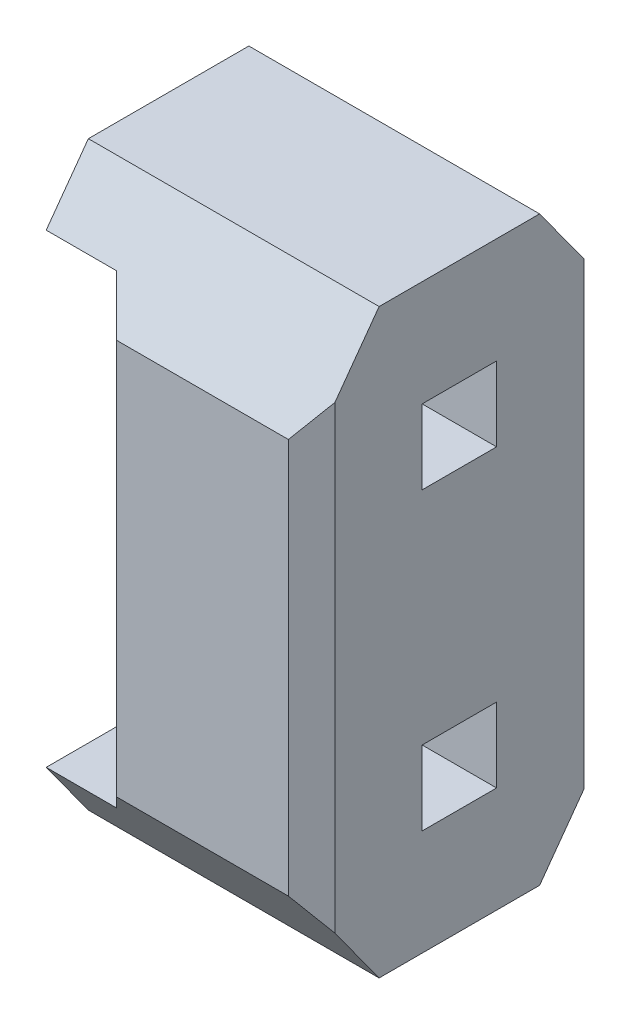
ISO-10303-21;
HEADER;
FILE_DESCRIPTION(('STEP AP214'),'2;1');
FILE_NAME('part.step','',(''),(''),'','','');
FILE_SCHEMA(('AUTOMOTIVE_DESIGN { 1 0 10303 214 1 1 1 1 }'));
ENDSEC;
DATA;
#1=APPLICATION_CONTEXT('core data for automotive mechanical design processes');
#2=APPLICATION_PROTOCOL_DEFINITION('international standard','automotive_design',2000,#1);
#3=PRODUCT_CONTEXT('',#1,'mechanical');
#4=PRODUCT('Part','Part','',(#3));
#5=PRODUCT_RELATED_PRODUCT_CATEGORY('part','',(#4));
#6=PRODUCT_DEFINITION_FORMATION('','',#4);
#7=PRODUCT_DEFINITION_CONTEXT('part definition',#1,'design');
#8=PRODUCT_DEFINITION('design','',#6,#7);
#9=PRODUCT_DEFINITION_SHAPE('','',#8);
#10=(LENGTH_UNIT() NAMED_UNIT(*) SI_UNIT(.MILLI.,.METRE.));
#11=(NAMED_UNIT(*) PLANE_ANGLE_UNIT() SI_UNIT($,.RADIAN.));
#12=(NAMED_UNIT(*) SI_UNIT($,.STERADIAN.) SOLID_ANGLE_UNIT());
#13=UNCERTAINTY_MEASURE_WITH_UNIT(LENGTH_MEASURE(1.E-05),#10,'distance_accuracy_value','');
#14=(GEOMETRIC_REPRESENTATION_CONTEXT(3) GLOBAL_UNCERTAINTY_ASSIGNED_CONTEXT((#13)) GLOBAL_UNIT_ASSIGNED_CONTEXT((#10,
#11,#12)) REPRESENTATION_CONTEXT('',''));
#15=CARTESIAN_POINT('',(0.,0.,0.));
#16=DIRECTION('',(0.,0.,1.));
#17=DIRECTION('',(1.,0.,0.));
#18=AXIS2_PLACEMENT_3D('',#15,#16,#17);
#19=CARTESIAN_POINT('',(1.25,4.6,-40.93));
#20=DIRECTION('',(0.,0.586967571460905,0.809610443394407));
#21=DIRECTION('',(0.,-0.809610443394407,0.586967571460905));
#22=AXIS2_PLACEMENT_3D('',#19,#20,#21);
#23=PLANE('',#22);
#24=DIRECTION('',(1.,0.,0.));
#25=VECTOR('',#24,1.);
#26=CARTESIAN_POINT('',(1.25,4.5,-40.8575));
#27=LINE('',#26,#25);
#28=CARTESIAN_POINT('',(0.,4.5,-40.8575));
#29=VERTEX_POINT('',#28);
#30=CARTESIAN_POINT('',(0.602500000000325,4.5,-40.8575000000001));
#31=VERTEX_POINT('',#30);
#32=EDGE_CURVE('E199',#29,#31,#27,.T.);
#33=ORIENTED_EDGE('',*,*,#32,.T.);
#34=DIRECTION('',(0.506207656348697,-0.698217457033984,0.506207656349602));
#35=VECTOR('',#34,1.);
#36=CARTESIAN_POINT('',(0.6025000000002,4.5,-40.8575));
#37=LINE('',#36,#35);
#38=CARTESIAN_POINT('',(0.819999999999671,4.2,-40.6399999999999));
#39=VERTEX_POINT('',#38);
#40=EDGE_CURVE('E197',#31,#39,#37,.T.);
#41=ORIENTED_EDGE('',*,*,#40,.T.);
#42=DIRECTION('',(1.,0.,0.));
#43=VECTOR('',#42,1.);
#44=CARTESIAN_POINT('',(1.25,4.19999999999999,-40.64));
#45=LINE('',#44,#43);
#46=CARTESIAN_POINT('',(2.30000000000012,4.2,-40.6399999999999));
#47=VERTEX_POINT('',#46);
#48=EDGE_CURVE('E20',#39,#47,#45,.T.);
#49=ORIENTED_EDGE('',*,*,#48,.T.);
#50=DIRECTION('',(0.506207656348957,0.698217457033858,-0.506207656349515));
#51=VECTOR('',#50,1.);
#52=CARTESIAN_POINT('',(2.3,4.19999999999999,-40.64));
#53=LINE('',#52,#51);
#54=CARTESIAN_POINT('',(2.49999999999988,4.47586206896592,-40.8400000000002));
#55=VERTEX_POINT('',#54);
#56=EDGE_CURVE('E181',#47,#55,#53,.T.);
#57=ORIENTED_EDGE('',*,*,#56,.T.);
#58=DIRECTION('',(0.,-0.809610443394407,0.586967571460905));
#59=VECTOR('',#58,1.);
#60=CARTESIAN_POINT('',(2.5,4.6,-40.93));
#61=LINE('',#60,#59);
#62=CARTESIAN_POINT('',(2.5,5.,-41.22));
#63=VERTEX_POINT('',#62);
#64=EDGE_CURVE('E188',#55,#63,#61,.F.);
#65=ORIENTED_EDGE('',*,*,#64,.T.);
#66=DIRECTION('',(1.,0.,0.));
#67=VECTOR('',#66,1.);
#68=CARTESIAN_POINT('',(1.25,5.,-41.22));
#69=LINE('',#68,#67);
#70=CARTESIAN_POINT('',(0.,5.,-41.22));
#71=VERTEX_POINT('',#70);
#72=EDGE_CURVE('E215',#71,#63,#69,.T.);
#73=ORIENTED_EDGE('',*,*,#72,.F.);
#74=DIRECTION('',(0.,-0.809610443394407,0.586967571460905));
#75=VECTOR('',#74,1.);
#76=CARTESIAN_POINT('',(0.,4.6,-40.93));
#77=LINE('',#76,#75);
#78=EDGE_CURVE('E207',#71,#29,#77,.T.);
#79=ORIENTED_EDGE('',*,*,#78,.T.);
#80=EDGE_LOOP('',(#33,#41,#49,#57,#65,#73,#79));
#81=FACE_BOUND('',#80,.T.);
#82=ADVANCED_FACE('F17',(#81),#23,.T.);
#83=CARTESIAN_POINT('',(1.25,4.6,-42.89));
#84=DIRECTION('',(0.,-0.586967571460905,0.809610443394407));
#85=DIRECTION('',(0.,-0.809610443394407,-0.586967571460905));
#86=AXIS2_PLACEMENT_3D('',#83,#84,#85);
#87=PLANE('',#86);
#88=DIRECTION('',(0.,-0.809610443394407,-0.586967571460905));
#89=VECTOR('',#88,1.);
#90=CARTESIAN_POINT('',(0.,4.6,-42.89));
#91=LINE('',#90,#89);
#92=CARTESIAN_POINT('',(0.,5.00000000000001,-42.6));
#93=VERTEX_POINT('',#92);
#94=CARTESIAN_POINT('',(0.,4.5,-42.9625));
#95=VERTEX_POINT('',#94);
#96=EDGE_CURVE('E263',#93,#95,#91,.T.);
#97=ORIENTED_EDGE('',*,*,#96,.F.);
#98=DIRECTION('',(1.,0.,0.));
#99=VECTOR('',#98,1.);
#100=CARTESIAN_POINT('',(1.25,5.,-42.6));
#101=LINE('',#100,#99);
#102=CARTESIAN_POINT('',(2.5,5.,-42.6));
#103=VERTEX_POINT('',#102);
#104=EDGE_CURVE('E227',#103,#93,#101,.F.);
#105=ORIENTED_EDGE('',*,*,#104,.F.);
#106=DIRECTION('',(0.,-0.809610443394407,-0.586967571460905));
#107=VECTOR('',#106,1.);
#108=CARTESIAN_POINT('',(2.5,4.6,-42.89));
#109=LINE('',#108,#107);
#110=CARTESIAN_POINT('',(2.49999999999988,4.47586206896592,-42.9799999999998));
#111=VERTEX_POINT('',#110);
#112=EDGE_CURVE('E223',#111,#103,#109,.F.);
#113=ORIENTED_EDGE('',*,*,#112,.F.);
#114=DIRECTION('',(0.506207656348954,0.698217457033861,0.506207656349513));
#115=VECTOR('',#114,1.);
#116=CARTESIAN_POINT('',(2.3,4.19999999999999,-43.18));
#117=LINE('',#116,#115);
#118=CARTESIAN_POINT('',(2.30000000000012,4.2,-43.1800000000001));
#119=VERTEX_POINT('',#118);
#120=EDGE_CURVE('E266',#119,#111,#117,.T.);
#121=ORIENTED_EDGE('',*,*,#120,.F.);
#122=DIRECTION('',(1.,0.,0.));
#123=VECTOR('',#122,1.);
#124=CARTESIAN_POINT('',(1.25,4.19999999999999,-43.18));
#125=LINE('',#124,#123);
#126=CARTESIAN_POINT('',(0.819999999999671,4.2,-43.1800000000001));
#127=VERTEX_POINT('',#126);
#128=EDGE_CURVE('E205',#127,#119,#125,.T.);
#129=ORIENTED_EDGE('',*,*,#128,.F.);
#130=DIRECTION('',(0.506207656348697,-0.698217457033984,-0.506207656349602));
#131=VECTOR('',#130,1.);
#132=CARTESIAN_POINT('',(0.6025000000002,4.5,-42.9625));
#133=LINE('',#132,#131);
#134=CARTESIAN_POINT('',(0.602500000000324,4.5,-42.9624999999999));
#135=VERTEX_POINT('',#134);
#136=EDGE_CURVE('E203',#135,#127,#133,.T.);
#137=ORIENTED_EDGE('',*,*,#136,.F.);
#138=DIRECTION('',(1.,0.,0.));
#139=VECTOR('',#138,1.);
#140=CARTESIAN_POINT('',(1.25,4.5,-42.9625));
#141=LINE('',#140,#139);
#142=EDGE_CURVE('E261',#95,#135,#141,.T.);
#143=ORIENTED_EDGE('',*,*,#142,.F.);
#144=EDGE_LOOP('',(#97,#105,#113,#121,#129,#137,#143));
#145=FACE_BOUND('',#144,.T.);
#146=ADVANCED_FACE('F285',(#145),#87,.F.);
#147=CARTESIAN_POINT('',(1.25,0.4,-42.89));
#148=DIRECTION('',(0.,0.586967571460905,0.809610443394407));
#149=DIRECTION('',(0.,-0.809610443394407,0.586967571460905));
#150=AXIS2_PLACEMENT_3D('',#147,#148,#149);
#151=PLANE('',#150);
#152=DIRECTION('',(-0.5062076563494,0.698217457033649,-0.506207656349361));
#153=VECTOR('',#152,1.);
#154=CARTESIAN_POINT('',(2.5,0.524137931034493,-42.98));
#155=LINE('',#154,#153);
#156=CARTESIAN_POINT('',(2.49999999999988,0.524137931034496,-42.9799999999999));
#157=VERTEX_POINT('',#156);
#158=CARTESIAN_POINT('',(2.30000000000012,0.800000000000004,-43.1800000000001));
#159=VERTEX_POINT('',#158);
#160=EDGE_CURVE('E251',#157,#159,#155,.T.);
#161=ORIENTED_EDGE('',*,*,#160,.F.);
#162=DIRECTION('',(0.,-0.809610443394407,0.586967571460905));
#163=VECTOR('',#162,1.);
#164=CARTESIAN_POINT('',(2.5,0.4,-42.89));
#165=LINE('',#164,#163);
#166=CARTESIAN_POINT('',(2.5,0.,-42.6));
#167=VERTEX_POINT('',#166);
#168=EDGE_CURVE('E253',#167,#157,#165,.F.);
#169=ORIENTED_EDGE('',*,*,#168,.F.);
#170=DIRECTION('',(1.,0.,0.));
#171=VECTOR('',#170,1.);
#172=CARTESIAN_POINT('',(1.25,0.,-42.6));
#173=LINE('',#172,#171);
#174=CARTESIAN_POINT('',(0.,0.,-42.6));
#175=VERTEX_POINT('',#174);
#176=EDGE_CURVE('E288',#167,#175,#173,.F.);
#177=ORIENTED_EDGE('',*,*,#176,.T.);
#178=DIRECTION('',(0.,-0.809610443394407,0.586967571460905));
#179=VECTOR('',#178,1.);
#180=CARTESIAN_POINT('',(0.,0.4,-42.89));
#181=LINE('',#180,#179);
#182=CARTESIAN_POINT('',(0.,0.5,-42.9625));
#183=VERTEX_POINT('',#182);
#184=EDGE_CURVE('E255',#183,#175,#181,.T.);
#185=ORIENTED_EDGE('',*,*,#184,.F.);
#186=DIRECTION('',(1.,0.,0.));
#187=VECTOR('',#186,1.);
#188=CARTESIAN_POINT('',(1.25,0.500000000000001,-42.9625));
#189=LINE('',#188,#187);
#190=CARTESIAN_POINT('',(0.602500000000324,0.5,-42.9624999999999));
#191=VERTEX_POINT('',#190);
#192=EDGE_CURVE('E257',#191,#183,#189,.F.);
#193=ORIENTED_EDGE('',*,*,#192,.F.);
#194=DIRECTION('',(-0.506207656348696,-0.698217457033985,0.506207656349601));
#195=VECTOR('',#194,1.);
#196=CARTESIAN_POINT('',(0.8199999999998,0.800000000000008,-43.18));
#197=LINE('',#196,#195);
#198=CARTESIAN_POINT('',(0.819999999999671,0.800000000000004,-43.1800000000001));
#199=VERTEX_POINT('',#198);
#200=EDGE_CURVE('E259',#199,#191,#197,.T.);
#201=ORIENTED_EDGE('',*,*,#200,.F.);
#202=DIRECTION('',(1.,0.,0.));
#203=VECTOR('',#202,1.);
#204=CARTESIAN_POINT('',(1.25,0.800000000000008,-43.18));
#205=LINE('',#204,#203);
#206=EDGE_CURVE('E249',#159,#199,#205,.F.);
#207=ORIENTED_EDGE('',*,*,#206,.F.);
#208=EDGE_LOOP('',(#161,#169,#177,#185,#193,#201,#207));
#209=FACE_BOUND('',#208,.T.);
#210=ADVANCED_FACE('F431',(#209),#151,.F.);
#211=CARTESIAN_POINT('',(1.25,0.4,-40.93));
#212=DIRECTION('',(0.,-0.586967571460905,0.809610443394407));
#213=DIRECTION('',(0.,-0.809610443394407,-0.586967571460905));
#214=AXIS2_PLACEMENT_3D('',#211,#212,#213);
#215=PLANE('',#214);
#216=DIRECTION('',(1.,0.,0.));
#217=VECTOR('',#216,1.);
#218=CARTESIAN_POINT('',(1.25,0.800000000000008,-40.64));
#219=LINE('',#218,#217);
#220=CARTESIAN_POINT('',(2.30000000000012,0.800000000000004,-40.6399999999999));
#221=VERTEX_POINT('',#220);
#222=CARTESIAN_POINT('',(0.819999999999671,0.800000000000004,-40.6399999999999));
#223=VERTEX_POINT('',#222);
#224=EDGE_CURVE('E191',#221,#223,#219,.F.);
#225=ORIENTED_EDGE('',*,*,#224,.T.);
#226=DIRECTION('',(-0.506207656348696,-0.698217457033985,-0.506207656349601));
#227=VECTOR('',#226,1.);
#228=CARTESIAN_POINT('',(0.8199999999998,0.800000000000008,-40.64));
#229=LINE('',#228,#227);
#230=CARTESIAN_POINT('',(0.602500000000324,0.5,-40.8575000000001));
#231=VERTEX_POINT('',#230);
#232=EDGE_CURVE('E232',#223,#231,#229,.T.);
#233=ORIENTED_EDGE('',*,*,#232,.T.);
#234=DIRECTION('',(1.,0.,0.));
#235=VECTOR('',#234,1.);
#236=CARTESIAN_POINT('',(1.25,0.500000000000001,-40.8575));
#237=LINE('',#236,#235);
#238=CARTESIAN_POINT('',(0.,0.5,-40.8575));
#239=VERTEX_POINT('',#238);
#240=EDGE_CURVE('E246',#231,#239,#237,.F.);
#241=ORIENTED_EDGE('',*,*,#240,.T.);
#242=DIRECTION('',(0.,-0.809610443394407,-0.586967571460905));
#243=VECTOR('',#242,1.);
#244=CARTESIAN_POINT('',(0.,0.4,-40.93));
#245=LINE('',#244,#243);
#246=CARTESIAN_POINT('',(0.,0.,-41.22));
#247=VERTEX_POINT('',#246);
#248=EDGE_CURVE('E244',#239,#247,#245,.T.);
#249=ORIENTED_EDGE('',*,*,#248,.T.);
#250=DIRECTION('',(1.,0.,0.));
#251=VECTOR('',#250,1.);
#252=CARTESIAN_POINT('',(1.25,0.,-41.22));
#253=LINE('',#252,#251);
#254=CARTESIAN_POINT('',(2.5,0.,-41.22));
#255=VERTEX_POINT('',#254);
#256=EDGE_CURVE('E293',#247,#255,#253,.T.);
#257=ORIENTED_EDGE('',*,*,#256,.T.);
#258=DIRECTION('',(0.,-0.809610443394407,-0.586967571460905));
#259=VECTOR('',#258,1.);
#260=CARTESIAN_POINT('',(2.5,0.4,-40.93));
#261=LINE('',#260,#259);
#262=CARTESIAN_POINT('',(2.49999999999988,0.524137931034499,-40.8400000000001));
#263=VERTEX_POINT('',#262);
#264=EDGE_CURVE('E241',#255,#263,#261,.F.);
#265=ORIENTED_EDGE('',*,*,#264,.T.);
#266=DIRECTION('',(-0.506207656349409,0.698217457033648,0.506207656349353));
#267=VECTOR('',#266,1.);
#268=CARTESIAN_POINT('',(2.5,0.524137931034498,-40.84));
#269=LINE('',#268,#267);
#270=EDGE_CURVE('E239',#263,#221,#269,.T.);
#271=ORIENTED_EDGE('',*,*,#270,.T.);
#272=EDGE_LOOP('',(#225,#233,#241,#249,#257,#265,#271));
#273=FACE_BOUND('',#272,.T.);
#274=ADVANCED_FACE('F421',(#273),#215,.T.);
#275=CARTESIAN_POINT('',(1.25,5.,-41.91));
#276=DIRECTION('',(0.,1.,0.));
#277=DIRECTION('',(0.,0.,1.));
#278=AXIS2_PLACEMENT_3D('',#275,#276,#277);
#279=PLANE('',#278);
#280=ORIENTED_EDGE('',*,*,#104,.T.);
#281=DIRECTION('',(0.,0.,-1.));
#282=VECTOR('',#281,1.);
#283=CARTESIAN_POINT('',(0.,5.,-41.91));
#284=LINE('',#283,#282);
#285=EDGE_CURVE('E231',#93,#71,#284,.F.);
#286=ORIENTED_EDGE('',*,*,#285,.T.);
#287=ORIENTED_EDGE('',*,*,#72,.T.);
#288=DIRECTION('',(0.,0.,1.));
#289=VECTOR('',#288,1.);
#290=CARTESIAN_POINT('',(2.5,5.,-41.91));
#291=LINE('',#290,#289);
#292=EDGE_CURVE('E219',#63,#103,#291,.F.);
#293=ORIENTED_EDGE('',*,*,#292,.T.);
#294=EDGE_LOOP('',(#280,#286,#287,#293));
#295=FACE_BOUND('',#294,.T.);
#296=ADVANCED_FACE('F229',(#295),#279,.T.);
#297=CARTESIAN_POINT('',(1.25,0.,-41.91));
#298=DIRECTION('',(0.,1.,0.));
#299=DIRECTION('',(0.,0.,1.));
#300=AXIS2_PLACEMENT_3D('',#297,#298,#299);
#301=PLANE('',#300);
#302=DIRECTION('',(0.,0.,-1.));
#303=VECTOR('',#302,1.);
#304=CARTESIAN_POINT('',(0.,0.,-41.91));
#305=LINE('',#304,#303);
#306=EDGE_CURVE('E297',#247,#175,#305,.T.);
#307=ORIENTED_EDGE('',*,*,#306,.T.);
#308=ORIENTED_EDGE('',*,*,#176,.F.);
#309=DIRECTION('',(0.,0.,1.));
#310=VECTOR('',#309,1.);
#311=CARTESIAN_POINT('',(2.5,0.,-41.91));
#312=LINE('',#311,#310);
#313=EDGE_CURVE('E287',#255,#167,#312,.F.);
#314=ORIENTED_EDGE('',*,*,#313,.F.);
#315=ORIENTED_EDGE('',*,*,#256,.F.);
#316=EDGE_LOOP('',(#307,#308,#314,#315));
#317=FACE_BOUND('',#316,.T.);
#318=ADVANCED_FACE('F428',(#317),#301,.F.);
#319=CARTESIAN_POINT('',(0.,4.75,-41.91));
#320=DIRECTION('',(1.,0.,0.));
#321=DIRECTION('',(0.,0.,-1.));
#322=AXIS2_PLACEMENT_3D('',#319,#320,#321);
#323=PLANE('',#322);
#324=ORIENTED_EDGE('',*,*,#285,.F.);
#325=ORIENTED_EDGE('',*,*,#96,.T.);
#326=DIRECTION('',(0.,0.,1.));
#327=VECTOR('',#326,1.);
#328=CARTESIAN_POINT('',(0.,4.5,-41.91));
#329=LINE('',#328,#327);
#330=EDGE_CURVE('E307',#95,#29,#329,.T.);
#331=ORIENTED_EDGE('',*,*,#330,.T.);
#332=ORIENTED_EDGE('',*,*,#78,.F.);
#333=EDGE_LOOP('',(#324,#325,#331,#332));
#334=FACE_BOUND('',#333,.T.);
#335=ADVANCED_FACE('F441',(#334),#323,.F.);
#336=CARTESIAN_POINT('',(0.,0.25,-41.91));
#337=DIRECTION('',(1.,0.,0.));
#338=DIRECTION('',(0.,0.,-1.));
#339=AXIS2_PLACEMENT_3D('',#336,#337,#338);
#340=PLANE('',#339);
#341=ORIENTED_EDGE('',*,*,#306,.F.);
#342=ORIENTED_EDGE('',*,*,#248,.F.);
#343=DIRECTION('',(0.,0.,1.));
#344=VECTOR('',#343,1.);
#345=CARTESIAN_POINT('',(0.,0.5,-41.91));
#346=LINE('',#345,#344);
#347=EDGE_CURVE('E315',#183,#239,#346,.T.);
#348=ORIENTED_EDGE('',*,*,#347,.F.);
#349=ORIENTED_EDGE('',*,*,#184,.T.);
#350=EDGE_LOOP('',(#341,#342,#348,#349));
#351=FACE_BOUND('',#350,.T.);
#352=ADVANCED_FACE('F443',(#351),#340,.F.);
#353=CARTESIAN_POINT('',(1.55,3.45,-41.91));
#354=DIRECTION('',(0.,1.,0.));
#355=DIRECTION('',(0.,0.,1.));
#356=AXIS2_PLACEMENT_3D('',#353,#354,#355);
#357=PLANE('',#356);
#358=DIRECTION('',(1.,0.,0.));
#359=VECTOR('',#358,1.);
#360=CARTESIAN_POINT('',(1.55,3.45,-42.23));
#361=LINE('',#360,#359);
#362=CARTESIAN_POINT('',(0.6,3.45,-42.23));
#363=VERTEX_POINT('',#362);
#364=CARTESIAN_POINT('',(2.5,3.45,-42.23));
#365=VERTEX_POINT('',#364);
#366=EDGE_CURVE('E332',#363,#365,#361,.T.);
#367=ORIENTED_EDGE('',*,*,#366,.F.);
#368=DIRECTION('',(0.,0.,1.));
#369=VECTOR('',#368,1.);
#370=CARTESIAN_POINT('',(0.6,3.45,-41.91));
#371=LINE('',#370,#369);
#372=CARTESIAN_POINT('',(0.6,3.45,-41.59));
#373=VERTEX_POINT('',#372);
#374=EDGE_CURVE('E302',#363,#373,#371,.T.);
#375=ORIENTED_EDGE('',*,*,#374,.T.);
#376=DIRECTION('',(1.,0.,0.));
#377=VECTOR('',#376,1.);
#378=CARTESIAN_POINT('',(1.55,3.45,-41.59));
#379=LINE('',#378,#377);
#380=CARTESIAN_POINT('',(2.5,3.45,-41.59));
#381=VERTEX_POINT('',#380);
#382=EDGE_CURVE('E327',#373,#381,#379,.T.);
#383=ORIENTED_EDGE('',*,*,#382,.T.);
#384=DIRECTION('',(0.,0.,1.));
#385=VECTOR('',#384,1.);
#386=CARTESIAN_POINT('',(2.5,3.45,-41.91));
#387=LINE('',#386,#385);
#388=EDGE_CURVE('E300',#381,#365,#387,.F.);
#389=ORIENTED_EDGE('',*,*,#388,.T.);
#390=EDGE_LOOP('',(#367,#375,#383,#389));
#391=FACE_BOUND('',#390,.T.);
#392=ADVANCED_FACE('F398',(#391),#357,.T.);
#393=CARTESIAN_POINT('',(0.71,2.5,-43.07));
#394=DIRECTION('',(0.707106781190498,0.,0.707106781182598));
#395=DIRECTION('',(0.707106781182598,0.,-0.707106781190498));
#396=AXIS2_PLACEMENT_3D('',#393,#394,#395);
#397=PLANE('',#396);
#398=ORIENTED_EDGE('',*,*,#200,.T.);
#399=DIRECTION('',(0.707106781187161,0.,-0.707106781185934));
#400=VECTOR('',#399,1.);
#401=CARTESIAN_POINT('',(0.6000000000002,0.5,-42.96));
#402=LINE('',#401,#400);
#403=CARTESIAN_POINT('',(0.600000000000408,0.5,-42.9599999999997));
#404=VERTEX_POINT('',#403);
#405=EDGE_CURVE('E312',#404,#191,#402,.T.);
#406=ORIENTED_EDGE('',*,*,#405,.F.);
#407=DIRECTION('',(0.,1.,0.));
#408=VECTOR('',#407,1.);
#409=CARTESIAN_POINT('',(0.6,2.5,-42.96));
#410=LINE('',#409,#408);
#411=CARTESIAN_POINT('',(0.600000000000408,4.5,-42.9599999999997));
#412=VERTEX_POINT('',#411);
#413=EDGE_CURVE('E337',#404,#412,#410,.T.);
#414=ORIENTED_EDGE('',*,*,#413,.T.);
#415=DIRECTION('',(0.707106781187161,0.,-0.707106781185934));
#416=VECTOR('',#415,1.);
#417=CARTESIAN_POINT('',(0.6000000000002,4.5,-42.96));
#418=LINE('',#417,#416);
#419=EDGE_CURVE('E304',#412,#135,#418,.T.);
#420=ORIENTED_EDGE('',*,*,#419,.T.);
#421=ORIENTED_EDGE('',*,*,#136,.T.);
#422=DIRECTION('',(0.,1.,0.));
#423=VECTOR('',#422,1.);
#424=CARTESIAN_POINT('',(0.8199999999998,2.5,-43.18));
#425=LINE('',#424,#423);
#426=EDGE_CURVE('E275',#127,#199,#425,.F.);
#427=ORIENTED_EDGE('',*,*,#426,.T.);
#428=EDGE_LOOP('',(#398,#406,#414,#420,#421,#427));
#429=FACE_BOUND('',#428,.T.);
#430=ADVANCED_FACE('F435',(#429),#397,.F.);
#431=CARTESIAN_POINT('',(0.30125,4.5,-41.91));
#432=DIRECTION('',(0.,1.,0.));
#433=DIRECTION('',(0.,0.,1.));
#434=AXIS2_PLACEMENT_3D('',#431,#432,#433);
#435=PLANE('',#434);
#436=ORIENTED_EDGE('',*,*,#142,.T.);
#437=ORIENTED_EDGE('',*,*,#419,.F.);
#438=DIRECTION('',(0.,0.,-1.));
#439=VECTOR('',#438,1.);
#440=CARTESIAN_POINT('',(0.6,4.5,-41.91));
#441=LINE('',#440,#439);
#442=CARTESIAN_POINT('',(0.600000000000279,4.5,-40.8600000000001));
#443=VERTEX_POINT('',#442);
#444=EDGE_CURVE('E339',#412,#443,#441,.F.);
#445=ORIENTED_EDGE('',*,*,#444,.T.);
#446=DIRECTION('',(-0.707106781182598,0.,-0.707106781190498));
#447=VECTOR('',#446,1.);
#448=CARTESIAN_POINT('',(0.71,4.5,-40.75));
#449=LINE('',#448,#447);
#450=EDGE_CURVE('E310',#443,#31,#449,.F.);
#451=ORIENTED_EDGE('',*,*,#450,.T.);
#452=ORIENTED_EDGE('',*,*,#32,.F.);
#453=ORIENTED_EDGE('',*,*,#330,.F.);
#454=EDGE_LOOP('',(#436,#437,#445,#451,#452,#453));
#455=FACE_BOUND('',#454,.T.);
#456=ADVANCED_FACE('F439',(#455),#435,.F.);
#457=CARTESIAN_POINT('',(0.71,2.5,-40.75));
#458=DIRECTION('',(0.707106781190498,0.,-0.707106781182598));
#459=DIRECTION('',(-0.707106781182598,0.,-0.707106781190498));
#460=AXIS2_PLACEMENT_3D('',#457,#458,#459);
#461=PLANE('',#460);
#462=ORIENTED_EDGE('',*,*,#232,.F.);
#463=DIRECTION('',(0.,1.,0.));
#464=VECTOR('',#463,1.);
#465=CARTESIAN_POINT('',(0.8199999999998,2.5,-40.64));
#466=LINE('',#465,#464);
#467=EDGE_CURVE('E325',#39,#223,#466,.F.);
#468=ORIENTED_EDGE('',*,*,#467,.F.);
#469=ORIENTED_EDGE('',*,*,#40,.F.);
#470=ORIENTED_EDGE('',*,*,#450,.F.);
#471=DIRECTION('',(0.,1.,0.));
#472=VECTOR('',#471,1.);
#473=CARTESIAN_POINT('',(0.6,2.5,-40.86));
#474=LINE('',#473,#472);
#475=CARTESIAN_POINT('',(0.600000000000408,0.5,-40.8600000000003));
#476=VERTEX_POINT('',#475);
#477=EDGE_CURVE('E341',#443,#476,#474,.F.);
#478=ORIENTED_EDGE('',*,*,#477,.T.);
#479=DIRECTION('',(-0.707106781187161,0.,-0.707106781185934));
#480=VECTOR('',#479,1.);
#481=CARTESIAN_POINT('',(0.6025000000002,0.5,-40.8575));
#482=LINE('',#481,#480);
#483=EDGE_CURVE('E318',#231,#476,#482,.T.);
#484=ORIENTED_EDGE('',*,*,#483,.F.);
#485=EDGE_LOOP('',(#462,#468,#469,#470,#478,#484));
#486=FACE_BOUND('',#485,.T.);
#487=ADVANCED_FACE('F416',(#486),#461,.F.);
#488=CARTESIAN_POINT('',(0.30125,0.5,-41.91));
#489=DIRECTION('',(0.,1.,0.));
#490=DIRECTION('',(0.,0.,1.));
#491=AXIS2_PLACEMENT_3D('',#488,#489,#490);
#492=PLANE('',#491);
#493=ORIENTED_EDGE('',*,*,#483,.T.);
#494=DIRECTION('',(0.,0.,-1.));
#495=VECTOR('',#494,1.);
#496=CARTESIAN_POINT('',(0.6,0.5,-41.91));
#497=LINE('',#496,#495);
#498=EDGE_CURVE('E343',#476,#404,#497,.T.);
#499=ORIENTED_EDGE('',*,*,#498,.T.);
#500=ORIENTED_EDGE('',*,*,#405,.T.);
#501=ORIENTED_EDGE('',*,*,#192,.T.);
#502=ORIENTED_EDGE('',*,*,#347,.T.);
#503=ORIENTED_EDGE('',*,*,#240,.F.);
#504=EDGE_LOOP('',(#493,#499,#500,#501,#502,#503));
#505=FACE_BOUND('',#504,.T.);
#506=ADVANCED_FACE('F418',(#505),#492,.T.);
#507=CARTESIAN_POINT('',(1.55,1.23,-42.23));
#508=DIRECTION('',(0.,0.,1.));
#509=DIRECTION('',(1.,0.,0.));
#510=AXIS2_PLACEMENT_3D('',#507,#508,#509);
#511=PLANE('',#510);
#512=DIRECTION('',(1.,0.,0.));
#513=VECTOR('',#512,1.);
#514=CARTESIAN_POINT('',(1.55,1.55,-42.23));
#515=LINE('',#514,#513);
#516=CARTESIAN_POINT('',(2.5,1.55,-42.23));
#517=VERTEX_POINT('',#516);
#518=CARTESIAN_POINT('',(0.6,1.55,-42.23));
#519=VERTEX_POINT('',#518);
#520=EDGE_CURVE('E283',#517,#519,#515,.F.);
#521=ORIENTED_EDGE('',*,*,#520,.T.);
#522=DIRECTION('',(0.,1.,0.));
#523=VECTOR('',#522,1.);
#524=CARTESIAN_POINT('',(0.6,2.5,-42.23));
#525=LINE('',#524,#523);
#526=CARTESIAN_POINT('',(0.6,0.91,-42.23));
#527=VERTEX_POINT('',#526);
#528=EDGE_CURVE('E346',#519,#527,#525,.F.);
#529=ORIENTED_EDGE('',*,*,#528,.T.);
#530=DIRECTION('',(1.,0.,0.));
#531=VECTOR('',#530,1.);
#532=CARTESIAN_POINT('',(1.55,0.91,-42.23));
#533=LINE('',#532,#531);
#534=CARTESIAN_POINT('',(2.5,0.91,-42.23));
#535=VERTEX_POINT('',#534);
#536=EDGE_CURVE('E354',#535,#527,#533,.F.);
#537=ORIENTED_EDGE('',*,*,#536,.F.);
#538=DIRECTION('',(0.,1.,0.));
#539=VECTOR('',#538,1.);
#540=CARTESIAN_POINT('',(2.5,1.23,-42.23));
#541=LINE('',#540,#539);
#542=EDGE_CURVE('E321',#535,#517,#541,.T.);
#543=ORIENTED_EDGE('',*,*,#542,.T.);
#544=EDGE_LOOP('',(#521,#529,#537,#543));
#545=FACE_BOUND('',#544,.T.);
#546=ADVANCED_FACE('F483',(#545),#511,.T.);
#547=CARTESIAN_POINT('',(1.56,2.5,-43.18));
#548=DIRECTION('',(0.,0.,1.));
#549=DIRECTION('',(1.,0.,0.));
#550=AXIS2_PLACEMENT_3D('',#547,#548,#549);
#551=PLANE('',#550);
#552=DIRECTION('',(0.,1.,0.));
#553=VECTOR('',#552,1.);
#554=CARTESIAN_POINT('',(2.30000000000047,2.5,-43.1800000000005));
#555=LINE('',#554,#553);
#556=EDGE_CURVE('E193',#159,#119,#555,.T.);
#557=ORIENTED_EDGE('',*,*,#556,.F.);
#558=ORIENTED_EDGE('',*,*,#206,.T.);
#559=ORIENTED_EDGE('',*,*,#426,.F.);
#560=ORIENTED_EDGE('',*,*,#128,.T.);
#561=EDGE_LOOP('',(#557,#558,#559,#560));
#562=FACE_BOUND('',#561,.T.);
#563=ADVANCED_FACE('F272',(#562),#551,.F.);
#564=CARTESIAN_POINT('',(1.56,2.5,-40.64));
#565=DIRECTION('',(0.,0.,1.));
#566=DIRECTION('',(1.,0.,0.));
#567=AXIS2_PLACEMENT_3D('',#564,#565,#566);
#568=PLANE('',#567);
#569=ORIENTED_EDGE('',*,*,#48,.F.);
#570=ORIENTED_EDGE('',*,*,#467,.T.);
#571=ORIENTED_EDGE('',*,*,#224,.F.);
#572=DIRECTION('',(0.,1.,0.));
#573=VECTOR('',#572,1.);
#574=CARTESIAN_POINT('',(2.30000000000047,2.5,-40.6399999999995));
#575=LINE('',#574,#573);
#576=EDGE_CURVE('E183',#47,#221,#575,.F.);
#577=ORIENTED_EDGE('',*,*,#576,.F.);
#578=EDGE_LOOP('',(#569,#570,#571,#577));
#579=FACE_BOUND('',#578,.T.);
#580=ADVANCED_FACE('F189',(#579),#568,.T.);
#581=CARTESIAN_POINT('',(1.55,3.77,-41.59));
#582=DIRECTION('',(0.,0.,1.));
#583=DIRECTION('',(1.,0.,0.));
#584=AXIS2_PLACEMENT_3D('',#581,#582,#583);
#585=PLANE('',#584);
#586=DIRECTION('',(0.,1.,0.));
#587=VECTOR('',#586,1.);
#588=CARTESIAN_POINT('',(2.5,3.77,-41.59));
#589=LINE('',#588,#587);
#590=CARTESIAN_POINT('',(2.5,4.09,-41.59));
#591=VERTEX_POINT('',#590);
#592=EDGE_CURVE('E330',#381,#591,#589,.T.);
#593=ORIENTED_EDGE('',*,*,#592,.F.);
#594=ORIENTED_EDGE('',*,*,#382,.F.);
#595=DIRECTION('',(0.,1.,0.));
#596=VECTOR('',#595,1.);
#597=CARTESIAN_POINT('',(0.6,2.5,-41.59));
#598=LINE('',#597,#596);
#599=CARTESIAN_POINT('',(0.6,4.09,-41.59));
#600=VERTEX_POINT('',#599);
#601=EDGE_CURVE('E351',#373,#600,#598,.T.);
#602=ORIENTED_EDGE('',*,*,#601,.T.);
#603=DIRECTION('',(1.,0.,0.));
#604=VECTOR('',#603,1.);
#605=CARTESIAN_POINT('',(1.55,4.09,-41.59));
#606=LINE('',#605,#604);
#607=EDGE_CURVE('E368',#600,#591,#606,.T.);
#608=ORIENTED_EDGE('',*,*,#607,.T.);
#609=EDGE_LOOP('',(#593,#594,#602,#608));
#610=FACE_BOUND('',#609,.T.);
#611=ADVANCED_FACE('F402',(#610),#585,.F.);
#612=CARTESIAN_POINT('',(1.55,3.77,-42.23));
#613=DIRECTION('',(0.,0.,1.));
#614=DIRECTION('',(1.,0.,0.));
#615=AXIS2_PLACEMENT_3D('',#612,#613,#614);
#616=PLANE('',#615);
#617=DIRECTION('',(1.,0.,0.));
#618=VECTOR('',#617,1.);
#619=CARTESIAN_POINT('',(1.55,4.09,-42.23));
#620=LINE('',#619,#618);
#621=CARTESIAN_POINT('',(2.5,4.09,-42.23));
#622=VERTEX_POINT('',#621);
#623=CARTESIAN_POINT('',(0.6,4.09,-42.23));
#624=VERTEX_POINT('',#623);
#625=EDGE_CURVE('E371',#622,#624,#620,.F.);
#626=ORIENTED_EDGE('',*,*,#625,.T.);
#627=DIRECTION('',(0.,1.,0.));
#628=VECTOR('',#627,1.);
#629=CARTESIAN_POINT('',(0.6,2.5,-42.23));
#630=LINE('',#629,#628);
#631=EDGE_CURVE('E348',#624,#363,#630,.F.);
#632=ORIENTED_EDGE('',*,*,#631,.T.);
#633=ORIENTED_EDGE('',*,*,#366,.T.);
#634=DIRECTION('',(0.,1.,0.));
#635=VECTOR('',#634,1.);
#636=CARTESIAN_POINT('',(2.5,3.77,-42.23));
#637=LINE('',#636,#635);
#638=EDGE_CURVE('E335',#365,#622,#637,.T.);
#639=ORIENTED_EDGE('',*,*,#638,.T.);
#640=EDGE_LOOP('',(#626,#632,#633,#639));
#641=FACE_BOUND('',#640,.T.);
#642=ADVANCED_FACE('F395',(#641),#616,.T.);
#643=CARTESIAN_POINT('',(0.6,2.5,-41.91));
#644=DIRECTION('',(1.,0.,0.));
#645=DIRECTION('',(0.,0.,-1.));
#646=AXIS2_PLACEMENT_3D('',#643,#644,#645);
#647=PLANE('',#646);
#648=ORIENTED_EDGE('',*,*,#374,.F.);
#649=ORIENTED_EDGE('',*,*,#631,.F.);
#650=DIRECTION('',(0.,0.,1.));
#651=VECTOR('',#650,1.);
#652=CARTESIAN_POINT('',(0.6,4.09,-41.91));
#653=LINE('',#652,#651);
#654=EDGE_CURVE('E192',#624,#600,#653,.T.);
#655=ORIENTED_EDGE('',*,*,#654,.T.);
#656=ORIENTED_EDGE('',*,*,#601,.F.);
#657=EDGE_LOOP('',(#648,#649,#655,#656));
#658=FACE_BOUND('',#657,.T.);
#659=ORIENTED_EDGE('',*,*,#528,.F.);
#660=DIRECTION('',(0.,0.,1.));
#661=VECTOR('',#660,1.);
#662=CARTESIAN_POINT('',(0.6,1.55,-41.91));
#663=LINE('',#662,#661);
#664=CARTESIAN_POINT('',(0.6,1.55,-41.59));
#665=VERTEX_POINT('',#664);
#666=EDGE_CURVE('E360',#519,#665,#663,.T.);
#667=ORIENTED_EDGE('',*,*,#666,.T.);
#668=DIRECTION('',(0.,1.,0.));
#669=VECTOR('',#668,1.);
#670=CARTESIAN_POINT('',(0.6,1.23,-41.59));
#671=LINE('',#670,#669);
#672=CARTESIAN_POINT('',(0.6,0.91,-41.59));
#673=VERTEX_POINT('',#672);
#674=EDGE_CURVE('E374',#665,#673,#671,.F.);
#675=ORIENTED_EDGE('',*,*,#674,.T.);
#676=DIRECTION('',(0.,0.,1.));
#677=VECTOR('',#676,1.);
#678=CARTESIAN_POINT('',(0.6,0.91,-41.91));
#679=LINE('',#678,#677);
#680=EDGE_CURVE('E357',#527,#673,#679,.T.);
#681=ORIENTED_EDGE('',*,*,#680,.F.);
#682=EDGE_LOOP('',(#659,#667,#675,#681));
#683=FACE_BOUND('',#682,.T.);
#684=ORIENTED_EDGE('',*,*,#477,.F.);
#685=ORIENTED_EDGE('',*,*,#444,.F.);
#686=ORIENTED_EDGE('',*,*,#413,.F.);
#687=ORIENTED_EDGE('',*,*,#498,.F.);
#688=EDGE_LOOP('',(#684,#685,#686,#687));
#689=FACE_BOUND('',#688,.T.);
#690=ADVANCED_FACE('F404',(#658,#683,#689),#647,.F.);
#691=CARTESIAN_POINT('',(1.55,0.91,-41.91));
#692=DIRECTION('',(0.,1.,0.));
#693=DIRECTION('',(0.,0.,1.));
#694=AXIS2_PLACEMENT_3D('',#691,#692,#693);
#695=PLANE('',#694);
#696=ORIENTED_EDGE('',*,*,#536,.T.);
#697=ORIENTED_EDGE('',*,*,#680,.T.);
#698=DIRECTION('',(1.,0.,0.));
#699=VECTOR('',#698,1.);
#700=CARTESIAN_POINT('',(1.55,0.91,-41.59));
#701=LINE('',#700,#699);
#702=CARTESIAN_POINT('',(2.5,0.91,-41.59));
#703=VERTEX_POINT('',#702);
#704=EDGE_CURVE('E376',#673,#703,#701,.T.);
#705=ORIENTED_EDGE('',*,*,#704,.T.);
#706=DIRECTION('',(0.,0.,1.));
#707=VECTOR('',#706,1.);
#708=CARTESIAN_POINT('',(2.5,0.91,-41.91));
#709=LINE('',#708,#707);
#710=EDGE_CURVE('E34',#703,#535,#709,.F.);
#711=ORIENTED_EDGE('',*,*,#710,.T.);
#712=EDGE_LOOP('',(#696,#697,#705,#711));
#713=FACE_BOUND('',#712,.T.);
#714=ADVANCED_FACE('F407',(#713),#695,.T.);
#715=CARTESIAN_POINT('',(1.55,1.55,-41.91));
#716=DIRECTION('',(0.,1.,0.));
#717=DIRECTION('',(0.,0.,1.));
#718=AXIS2_PLACEMENT_3D('',#715,#716,#717);
#719=PLANE('',#718);
#720=DIRECTION('',(0.,0.,1.));
#721=VECTOR('',#720,1.);
#722=CARTESIAN_POINT('',(2.5,1.55,-41.91));
#723=LINE('',#722,#721);
#724=CARTESIAN_POINT('',(2.5,1.55,-41.59));
#725=VERTEX_POINT('',#724);
#726=EDGE_CURVE('E362',#725,#517,#723,.F.);
#727=ORIENTED_EDGE('',*,*,#726,.F.);
#728=DIRECTION('',(1.,0.,0.));
#729=VECTOR('',#728,1.);
#730=CARTESIAN_POINT('',(1.55,1.55,-41.59));
#731=LINE('',#730,#729);
#732=EDGE_CURVE('E378',#725,#665,#731,.F.);
#733=ORIENTED_EDGE('',*,*,#732,.T.);
#734=ORIENTED_EDGE('',*,*,#666,.F.);
#735=ORIENTED_EDGE('',*,*,#520,.F.);
#736=EDGE_LOOP('',(#727,#733,#734,#735));
#737=FACE_BOUND('',#736,.T.);
#738=ADVANCED_FACE('F468',(#737),#719,.F.);
#739=CARTESIAN_POINT('',(2.4,2.5,-43.08));
#740=DIRECTION('',(0.707106781189898,0.,-0.707106781183198));
#741=DIRECTION('',(-0.707106781183198,0.,-0.707106781189898));
#742=AXIS2_PLACEMENT_3D('',#739,#740,#741);
#743=PLANE('',#742);
#744=DIRECTION('',(0.,1.,0.));
#745=VECTOR('',#744,1.);
#746=CARTESIAN_POINT('',(2.5,2.5,-42.98));
#747=LINE('',#746,#745);
#748=EDGE_CURVE('E381',#157,#111,#747,.T.);
#749=ORIENTED_EDGE('',*,*,#748,.F.);
#750=ORIENTED_EDGE('',*,*,#160,.T.);
#751=ORIENTED_EDGE('',*,*,#556,.T.);
#752=ORIENTED_EDGE('',*,*,#120,.T.);
#753=EDGE_LOOP('',(#749,#750,#751,#752));
#754=FACE_BOUND('',#753,.T.);
#755=ADVANCED_FACE('F281',(#754),#743,.T.);
#756=CARTESIAN_POINT('',(2.4,2.5,-40.74));
#757=DIRECTION('',(0.707106781189898,0.,0.707106781183198));
#758=DIRECTION('',(0.707106781183198,0.,-0.707106781189898));
#759=AXIS2_PLACEMENT_3D('',#756,#757,#758);
#760=PLANE('',#759);
#761=DIRECTION('',(0.,1.,0.));
#762=VECTOR('',#761,1.);
#763=CARTESIAN_POINT('',(2.5,2.5,-40.84));
#764=LINE('',#763,#762);
#765=EDGE_CURVE('E186',#55,#263,#764,.F.);
#766=ORIENTED_EDGE('',*,*,#765,.F.);
#767=ORIENTED_EDGE('',*,*,#56,.F.);
#768=ORIENTED_EDGE('',*,*,#576,.T.);
#769=ORIENTED_EDGE('',*,*,#270,.F.);
#770=EDGE_LOOP('',(#766,#767,#768,#769));
#771=FACE_BOUND('',#770,.T.);
#772=ADVANCED_FACE('F182',(#771),#760,.T.);
#773=CARTESIAN_POINT('',(1.55,4.09,-41.91));
#774=DIRECTION('',(0.,1.,0.));
#775=DIRECTION('',(0.,0.,1.));
#776=AXIS2_PLACEMENT_3D('',#773,#774,#775);
#777=PLANE('',#776);
#778=DIRECTION('',(0.,0.,-1.));
#779=VECTOR('',#778,1.);
#780=CARTESIAN_POINT('',(2.5,4.09,-41.91));
#781=LINE('',#780,#779);
#782=EDGE_CURVE('E26',#591,#622,#781,.T.);
#783=ORIENTED_EDGE('',*,*,#782,.F.);
#784=ORIENTED_EDGE('',*,*,#607,.F.);
#785=ORIENTED_EDGE('',*,*,#654,.F.);
#786=ORIENTED_EDGE('',*,*,#625,.F.);
#787=EDGE_LOOP('',(#783,#784,#785,#786));
#788=FACE_BOUND('',#787,.T.);
#789=ADVANCED_FACE('F392',(#788),#777,.F.);
#790=CARTESIAN_POINT('',(1.55,1.23,-41.59));
#791=DIRECTION('',(0.,0.,1.));
#792=DIRECTION('',(1.,0.,0.));
#793=AXIS2_PLACEMENT_3D('',#790,#791,#792);
#794=PLANE('',#793);
#795=DIRECTION('',(0.,1.,0.));
#796=VECTOR('',#795,1.);
#797=CARTESIAN_POINT('',(2.5,2.5,-41.59));
#798=LINE('',#797,#796);
#799=EDGE_CURVE('E11',#703,#725,#798,.T.);
#800=ORIENTED_EDGE('',*,*,#799,.F.);
#801=ORIENTED_EDGE('',*,*,#704,.F.);
#802=ORIENTED_EDGE('',*,*,#674,.F.);
#803=ORIENTED_EDGE('',*,*,#732,.F.);
#804=EDGE_LOOP('',(#800,#801,#802,#803));
#805=FACE_BOUND('',#804,.T.);
#806=ADVANCED_FACE('F454',(#805),#794,.F.);
#807=CARTESIAN_POINT('',(2.5,2.5,-41.91));
#808=DIRECTION('',(1.,0.,0.));
#809=DIRECTION('',(0.,0.,-1.));
#810=AXIS2_PLACEMENT_3D('',#807,#808,#809);
#811=PLANE('',#810);
#812=ORIENTED_EDGE('',*,*,#710,.F.);
#813=ORIENTED_EDGE('',*,*,#799,.T.);
#814=ORIENTED_EDGE('',*,*,#726,.T.);
#815=ORIENTED_EDGE('',*,*,#542,.F.);
#816=EDGE_LOOP('',(#812,#813,#814,#815));
#817=FACE_BOUND('',#816,.T.);
#818=ORIENTED_EDGE('',*,*,#592,.T.);
#819=ORIENTED_EDGE('',*,*,#782,.T.);
#820=ORIENTED_EDGE('',*,*,#638,.F.);
#821=ORIENTED_EDGE('',*,*,#388,.F.);
#822=EDGE_LOOP('',(#818,#819,#820,#821));
#823=FACE_BOUND('',#822,.T.);
#824=ORIENTED_EDGE('',*,*,#64,.F.);
#825=ORIENTED_EDGE('',*,*,#765,.T.);
#826=ORIENTED_EDGE('',*,*,#264,.F.);
#827=ORIENTED_EDGE('',*,*,#313,.T.);
#828=ORIENTED_EDGE('',*,*,#168,.T.);
#829=ORIENTED_EDGE('',*,*,#748,.T.);
#830=ORIENTED_EDGE('',*,*,#112,.T.);
#831=ORIENTED_EDGE('',*,*,#292,.F.);
#832=EDGE_LOOP('',(#824,#825,#826,#827,#828,#829,#830,#831));
#833=FACE_BOUND('',#832,.T.);
#834=ADVANCED_FACE('F220',(#817,#823,#833),#811,.T.);
#835=CLOSED_SHELL('',(#82,#146,#210,#274,#296,#318,#335,#352,#392,#430,#456,#487,#506,#546,#563,
#580,#611,#642,#690,#714,#738,#755,#772,#789,#806,#834));
#836=MANIFOLD_SOLID_BREP('B1',#835);
#837=ADVANCED_BREP_SHAPE_REPRESENTATION('',(#18,#836),#14);
#838=SHAPE_DEFINITION_REPRESENTATION(#9,#837);
ENDSEC;
END-ISO-10303-21;
